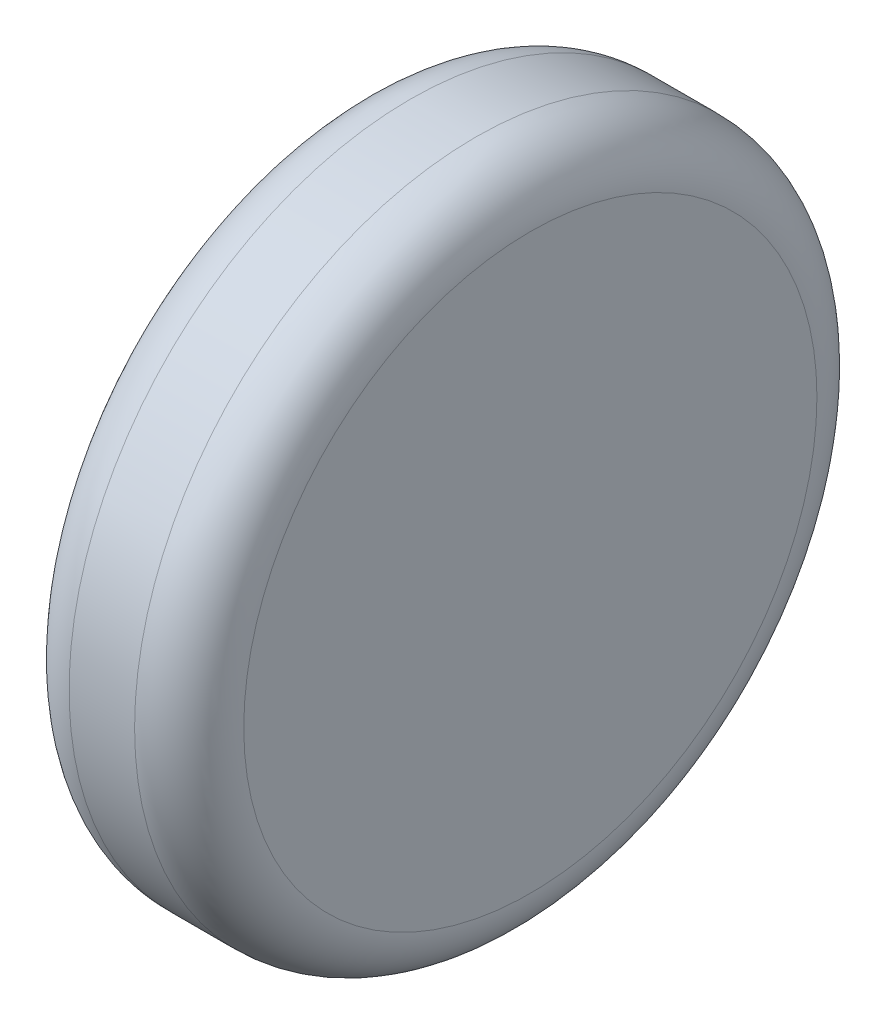
ISO-10303-21;
HEADER;
FILE_DESCRIPTION(('STEP AP214'),'2;1');
FILE_NAME('part.step','',(''),(''),'','','');
FILE_SCHEMA(('AUTOMOTIVE_DESIGN { 1 0 10303 214 1 1 1 1 }'));
ENDSEC;
DATA;
#1=APPLICATION_CONTEXT('core data for automotive mechanical design processes');
#2=APPLICATION_PROTOCOL_DEFINITION('international standard','automotive_design',2000,#1);
#3=PRODUCT_CONTEXT('',#1,'mechanical');
#4=PRODUCT('Part','Part','',(#3));
#5=PRODUCT_RELATED_PRODUCT_CATEGORY('part','',(#4));
#6=PRODUCT_DEFINITION_FORMATION('','',#4);
#7=PRODUCT_DEFINITION_CONTEXT('part definition',#1,'design');
#8=PRODUCT_DEFINITION('design','',#6,#7);
#9=PRODUCT_DEFINITION_SHAPE('','',#8);
#10=(LENGTH_UNIT() NAMED_UNIT(*) SI_UNIT(.MILLI.,.METRE.));
#11=(NAMED_UNIT(*) PLANE_ANGLE_UNIT() SI_UNIT($,.RADIAN.));
#12=(NAMED_UNIT(*) SI_UNIT($,.STERADIAN.) SOLID_ANGLE_UNIT());
#13=UNCERTAINTY_MEASURE_WITH_UNIT(LENGTH_MEASURE(1.E-05),#10,'distance_accuracy_value','');
#14=(GEOMETRIC_REPRESENTATION_CONTEXT(3) GLOBAL_UNCERTAINTY_ASSIGNED_CONTEXT((#13)) GLOBAL_UNIT_ASSIGNED_CONTEXT((#10,
#11,#12)) REPRESENTATION_CONTEXT('',''));
#15=CARTESIAN_POINT('',(0.,0.,0.));
#16=DIRECTION('',(0.,0.,1.));
#17=DIRECTION('',(1.,0.,0.));
#18=AXIS2_PLACEMENT_3D('',#15,#16,#17);
#19=CARTESIAN_POINT('',(0.284635714690617,-0.332340218761648,0.1012));
#20=DIRECTION('',(1.,0.,0.));
#21=DIRECTION('',(0.,1.,0.));
#22=AXIS2_PLACEMENT_3D('',#19,#20,#21);
#23=PLANE('',#22);
#24=CARTESIAN_POINT('',(0.284635714690617,-0.332340218761648,0.1012));
#25=DIRECTION('',(1.,0.,0.));
#26=DIRECTION('',(0.,0.,-1.));
#27=AXIS2_PLACEMENT_3D('',#24,#25,#26);
#28=CIRCLE('',#27,0.0262499999999999);
#29=CARTESIAN_POINT('',(0.284635714690617,-0.332340218761648,0.0749500000000001));
#30=VERTEX_POINT('',#29);
#31=CARTESIAN_POINT('',(0.284635714690617,-0.306090218761648,0.1012));
#32=VERTEX_POINT('',#31);
#33=EDGE_CURVE('E55',#30,#32,#28,.T.);
#34=ORIENTED_EDGE('',*,*,#33,.F.);
#35=CARTESIAN_POINT('',(0.284635714690617,-0.332340218761648,0.1012));
#36=DIRECTION('',(1.,0.,0.));
#37=DIRECTION('',(0.,0.,1.));
#38=AXIS2_PLACEMENT_3D('',#35,#36,#37);
#39=CIRCLE('',#38,0.02625);
#40=CARTESIAN_POINT('',(0.284635714690617,-0.332340218761648,0.12745));
#41=VERTEX_POINT('',#40);
#42=EDGE_CURVE('E49',#41,#30,#39,.T.);
#43=ORIENTED_EDGE('',*,*,#42,.F.);
#44=CARTESIAN_POINT('',(0.284635714690617,-0.332340218761648,0.1012));
#45=DIRECTION('',(1.,0.,0.));
#46=DIRECTION('',(0.,1.,0.));
#47=AXIS2_PLACEMENT_3D('',#44,#45,#46);
#48=CIRCLE('',#47,0.02625);
#49=EDGE_CURVE('E53',#32,#41,#48,.T.);
#50=ORIENTED_EDGE('',*,*,#49,.F.);
#51=EDGE_LOOP('',(#34,#43,#50));
#52=FACE_BOUND('',#51,.T.);
#53=ADVANCED_FACE('F17',(#52),#23,.F.);
#54=CARTESIAN_POINT('',(0.289635714690617,-0.332340218761648,0.1012));
#55=DIRECTION('',(1.,0.,0.));
#56=DIRECTION('',(0.,0.,1.));
#57=AXIS2_PLACEMENT_3D('',#54,#55,#56);
#58=TOROIDAL_SURFACE('',#57,0.02625,0.005);
#59=CARTESIAN_POINT('',(0.289635714690617,-0.332340218761648,0.1012));
#60=DIRECTION('',(1.,0.,0.));
#61=DIRECTION('',(0.,1.,0.));
#62=AXIS2_PLACEMENT_3D('',#59,#60,#61);
#63=CIRCLE('',#62,0.03125);
#64=CARTESIAN_POINT('',(0.289635714690617,-0.301090218761648,0.1012));
#65=VERTEX_POINT('',#64);
#66=EDGE_CURVE('E62',#65,#65,#63,.T.);
#67=ORIENTED_EDGE('',*,*,#66,.F.);
#68=EDGE_LOOP('',(#67));
#69=FACE_BOUND('',#68,.T.);
#70=ORIENTED_EDGE('',*,*,#33,.T.);
#71=ORIENTED_EDGE('',*,*,#49,.T.);
#72=ORIENTED_EDGE('',*,*,#42,.T.);
#73=EDGE_LOOP('',(#70,#71,#72));
#74=FACE_BOUND('',#73,.T.);
#75=ADVANCED_FACE('F60',(#69,#74),#58,.T.);
#76=CARTESIAN_POINT('',(0.300635714690617,-0.332340218761648,0.1012));
#77=DIRECTION('',(1.,0.,0.));
#78=DIRECTION('',(0.,1.,0.));
#79=AXIS2_PLACEMENT_3D('',#76,#77,#78);
#80=CYLINDRICAL_SURFACE('',#79,0.03125);
#81=CARTESIAN_POINT('',(0.295635714690617,-0.332340218761648,0.1012));
#82=DIRECTION('',(1.,0.,0.));
#83=DIRECTION('',(0.,0.,1.));
#84=AXIS2_PLACEMENT_3D('',#81,#82,#83);
#85=CIRCLE('',#84,0.03125);
#86=CARTESIAN_POINT('',(0.295635714690617,-0.332340218761648,0.13245));
#87=VERTEX_POINT('',#86);
#88=EDGE_CURVE('E86',#87,#87,#85,.T.);
#89=ORIENTED_EDGE('',*,*,#88,.F.);
#90=EDGE_LOOP('',(#89));
#91=FACE_BOUND('',#90,.T.);
#92=ORIENTED_EDGE('',*,*,#66,.T.);
#93=EDGE_LOOP('',(#92));
#94=FACE_BOUND('',#93,.T.);
#95=ADVANCED_FACE('F79',(#91,#94),#80,.T.);
#96=CARTESIAN_POINT('',(0.295635714690617,-0.332340218761648,0.1012));
#97=DIRECTION('',(1.,0.,0.));
#98=DIRECTION('',(0.,0.,1.));
#99=AXIS2_PLACEMENT_3D('',#96,#97,#98);
#100=TOROIDAL_SURFACE('',#99,0.02625,0.005);
#101=ORIENTED_EDGE('',*,*,#88,.T.);
#102=EDGE_LOOP('',(#101));
#103=FACE_BOUND('',#102,.T.);
#104=CARTESIAN_POINT('',(0.300635714690617,-0.332340218761648,0.1012));
#105=DIRECTION('',(-1.,0.,0.));
#106=DIRECTION('',(0.,0.,-1.));
#107=AXIS2_PLACEMENT_3D('',#104,#105,#106);
#108=CIRCLE('',#107,0.0262499999999999);
#109=CARTESIAN_POINT('',(0.300635714690617,-0.332340218761648,0.12745));
#110=VERTEX_POINT('',#109);
#111=CARTESIAN_POINT('',(0.300635714690617,-0.332340218761648,0.0749500000000001));
#112=VERTEX_POINT('',#111);
#113=EDGE_CURVE('E11',#110,#112,#108,.F.);
#114=ORIENTED_EDGE('',*,*,#113,.F.);
#115=CARTESIAN_POINT('',(0.300635714690617,-0.332340218761648,0.1012));
#116=DIRECTION('',(-1.,0.,0.));
#117=DIRECTION('',(0.,0.,1.));
#118=AXIS2_PLACEMENT_3D('',#115,#116,#117);
#119=CIRCLE('',#118,0.02625);
#120=CARTESIAN_POINT('',(0.300635714690617,-0.306090218761648,0.1012));
#121=VERTEX_POINT('',#120);
#122=EDGE_CURVE('E28',#121,#110,#119,.F.);
#123=ORIENTED_EDGE('',*,*,#122,.F.);
#124=CARTESIAN_POINT('',(0.300635714690617,-0.332340218761648,0.1012));
#125=DIRECTION('',(-1.,0.,0.));
#126=DIRECTION('',(0.,1.,0.));
#127=AXIS2_PLACEMENT_3D('',#124,#125,#126);
#128=CIRCLE('',#127,0.02625);
#129=EDGE_CURVE('E92',#112,#121,#128,.F.);
#130=ORIENTED_EDGE('',*,*,#129,.F.);
#131=EDGE_LOOP('',(#114,#123,#130));
#132=FACE_BOUND('',#131,.T.);
#133=ADVANCED_FACE('F117',(#103,#132),#100,.T.);
#134=CARTESIAN_POINT('',(0.300635714690617,-0.332340218761648,0.1012));
#135=DIRECTION('',(1.,0.,0.));
#136=DIRECTION('',(0.,1.,0.));
#137=AXIS2_PLACEMENT_3D('',#134,#135,#136);
#138=PLANE('',#137);
#139=ORIENTED_EDGE('',*,*,#122,.T.);
#140=ORIENTED_EDGE('',*,*,#113,.T.);
#141=ORIENTED_EDGE('',*,*,#129,.T.);
#142=EDGE_LOOP('',(#139,#140,#141));
#143=FACE_BOUND('',#142,.T.);
#144=ADVANCED_FACE('F99',(#143),#138,.T.);
#145=CLOSED_SHELL('',(#53,#75,#95,#133,#144));
#146=MANIFOLD_SOLID_BREP('B1',#145);
#147=ADVANCED_BREP_SHAPE_REPRESENTATION('',(#18,#146),#14);
#148=SHAPE_DEFINITION_REPRESENTATION(#9,#147);
ENDSEC;
END-ISO-10303-21;
